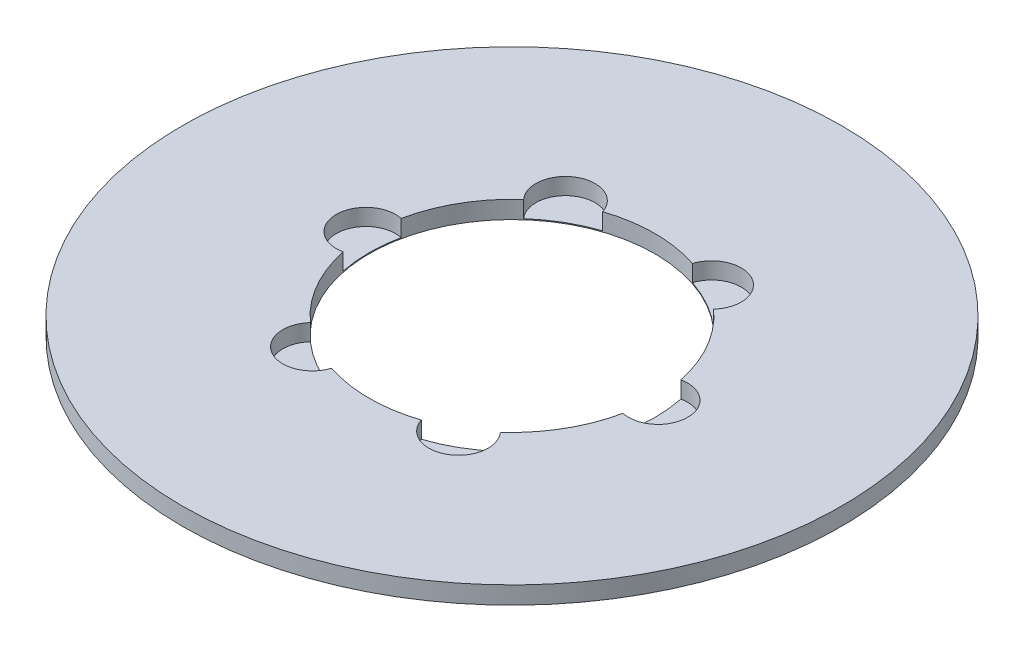
ISO-10303-21;
HEADER;
FILE_DESCRIPTION(('STEP AP214'),'2;1');
FILE_NAME('part.step','',(''),(''),'','','');
FILE_SCHEMA(('AUTOMOTIVE_DESIGN { 1 0 10303 214 1 1 1 1 }'));
ENDSEC;
DATA;
#1=APPLICATION_CONTEXT('core data for automotive mechanical design processes');
#2=APPLICATION_PROTOCOL_DEFINITION('international standard','automotive_design',2000,#1);
#3=PRODUCT_CONTEXT('',#1,'mechanical');
#4=PRODUCT('Part','Part','',(#3));
#5=PRODUCT_RELATED_PRODUCT_CATEGORY('part','',(#4));
#6=PRODUCT_DEFINITION_FORMATION('','',#4);
#7=PRODUCT_DEFINITION_CONTEXT('part definition',#1,'design');
#8=PRODUCT_DEFINITION('design','',#6,#7);
#9=PRODUCT_DEFINITION_SHAPE('','',#8);
#10=(LENGTH_UNIT() NAMED_UNIT(*) SI_UNIT(.MILLI.,.METRE.));
#11=(NAMED_UNIT(*) PLANE_ANGLE_UNIT() SI_UNIT($,.RADIAN.));
#12=(NAMED_UNIT(*) SI_UNIT($,.STERADIAN.) SOLID_ANGLE_UNIT());
#13=UNCERTAINTY_MEASURE_WITH_UNIT(LENGTH_MEASURE(1.E-05),#10,'distance_accuracy_value','');
#14=(GEOMETRIC_REPRESENTATION_CONTEXT(3) GLOBAL_UNCERTAINTY_ASSIGNED_CONTEXT((#13)) GLOBAL_UNIT_ASSIGNED_CONTEXT((#10,
#11,#12)) REPRESENTATION_CONTEXT('',''));
#15=CARTESIAN_POINT('',(0.,0.,0.));
#16=DIRECTION('',(0.,0.,1.));
#17=DIRECTION('',(1.,0.,0.));
#18=AXIS2_PLACEMENT_3D('',#15,#16,#17);
#19=CARTESIAN_POINT('',(0.,4.,0.));
#20=DIRECTION('',(0.,-1.,0.));
#21=DIRECTION('',(0.,0.,-1.));
#22=AXIS2_PLACEMENT_3D('',#19,#20,#21);
#23=CYLINDRICAL_SURFACE('',#22,75.);
#24=CARTESIAN_POINT('',(0.,4.,0.));
#25=DIRECTION('',(0.,1.,0.));
#26=DIRECTION('',(0.,0.,1.));
#27=AXIS2_PLACEMENT_3D('',#24,#25,#26);
#28=CIRCLE('',#27,75.);
#29=CARTESIAN_POINT('',(0.,4.,75.));
#30=VERTEX_POINT('',#29);
#31=EDGE_CURVE('E171',#30,#30,#28,.T.);
#32=ORIENTED_EDGE('',*,*,#31,.F.);
#33=EDGE_LOOP('',(#32));
#34=FACE_BOUND('',#33,.T.);
#35=CARTESIAN_POINT('',(0.,0.,0.));
#36=DIRECTION('',(0.,1.,0.));
#37=DIRECTION('',(0.,0.,1.));
#38=AXIS2_PLACEMENT_3D('',#35,#36,#37);
#39=CIRCLE('',#38,75.);
#40=CARTESIAN_POINT('',(0.,0.,75.));
#41=VERTEX_POINT('',#40);
#42=EDGE_CURVE('E157',#41,#41,#39,.T.);
#43=ORIENTED_EDGE('',*,*,#42,.T.);
#44=EDGE_LOOP('',(#43));
#45=FACE_BOUND('',#44,.T.);
#46=ADVANCED_FACE('F39',(#34,#45),#23,.T.);
#47=CARTESIAN_POINT('',(0.,4.,0.));
#48=DIRECTION('',(0.,1.,0.));
#49=DIRECTION('',(0.,0.,1.));
#50=AXIS2_PLACEMENT_3D('',#47,#48,#49);
#51=PLANE('',#50);
#52=CARTESIAN_POINT('',(-16.6261189361945,4.,-28.7972827301712));
#53=DIRECTION('',(0.,1.,0.));
#54=DIRECTION('',(-0.866025403784433,0.,0.50000000000001));
#55=AXIS2_PLACEMENT_3D('',#52,#53,#54);
#56=CIRCLE('',#55,6.74282518427116);
#57=CARTESIAN_POINT('',(-10.205310516986,4.,-30.8561442382533));
#58=VERTEX_POINT('',#57);
#59=CARTESIAN_POINT('',(-21.6195495146718,4.,-24.2661302803446));
#60=VERTEX_POINT('',#59);
#61=EDGE_CURVE('E214',#58,#60,#56,.T.);
#62=ORIENTED_EDGE('',*,*,#61,.F.);
#63=CARTESIAN_POINT('',(0.,4.,0.));
#64=DIRECTION('',(0.,1.,0.));
#65=DIRECTION('',(0.,0.,1.));
#66=AXIS2_PLACEMENT_3D('',#63,#64,#65);
#67=CIRCLE('',#66,32.5);
#68=CARTESIAN_POINT('',(10.2053105169854,4.,-30.8561442382536));
#69=VERTEX_POINT('',#68);
#70=EDGE_CURVE('E272',#69,#58,#67,.T.);
#71=ORIENTED_EDGE('',*,*,#70,.F.);
#72=CARTESIAN_POINT('',(16.6261189361939,4.,-28.7972827301715));
#73=DIRECTION('',(0.,1.,0.));
#74=DIRECTION('',(-0.866025403784443,0.,-0.499999999999992));
#75=AXIS2_PLACEMENT_3D('',#72,#73,#74);
#76=CIRCLE('',#75,6.74282518427116);
#77=CARTESIAN_POINT('',(21.6195495146713,4.,-24.266130280345));
#78=VERTEX_POINT('',#77);
#79=EDGE_CURVE('E285',#78,#69,#76,.T.);
#80=ORIENTED_EDGE('',*,*,#79,.F.);
#81=CARTESIAN_POINT('',(31.8248600316572,4.,-6.59001395790865));
#82=VERTEX_POINT('',#81);
#83=EDGE_CURVE('E165',#82,#78,#67,.T.);
#84=ORIENTED_EDGE('',*,*,#83,.F.);
#85=CARTESIAN_POINT('',(33.2522378723884,4.,0.));
#86=DIRECTION('',(0.,1.,0.));
#87=DIRECTION('',(0.,0.,-1.));
#88=AXIS2_PLACEMENT_3D('',#85,#86,#87);
#89=CIRCLE('',#88,6.74282518427116);
#90=CARTESIAN_POINT('',(31.8248600316572,4.,6.59001395790865));
#91=VERTEX_POINT('',#90);
#92=EDGE_CURVE('E281',#91,#82,#89,.T.);
#93=ORIENTED_EDGE('',*,*,#92,.F.);
#94=CARTESIAN_POINT('',(21.6195495146716,4.,24.2661302803447));
#95=VERTEX_POINT('',#94);
#96=EDGE_CURVE('E160',#95,#91,#67,.T.);
#97=ORIENTED_EDGE('',*,*,#96,.F.);
#98=CARTESIAN_POINT('',(16.6261189361943,4.,28.7972827301713));
#99=DIRECTION('',(0.,1.,0.));
#100=DIRECTION('',(0.866025403784436,0.,-0.500000000000004));
#101=AXIS2_PLACEMENT_3D('',#98,#99,#100);
#102=CIRCLE('',#101,6.74282518427116);
#103=CARTESIAN_POINT('',(10.2053105169858,4.,30.8561442382534));
#104=VERTEX_POINT('',#103);
#105=EDGE_CURVE('E154',#104,#95,#102,.T.);
#106=ORIENTED_EDGE('',*,*,#105,.F.);
#107=CARTESIAN_POINT('',(-10.2053105169856,4.,30.8561442382535));
#108=VERTEX_POINT('',#107);
#109=EDGE_CURVE('E150',#108,#104,#67,.T.);
#110=ORIENTED_EDGE('',*,*,#109,.F.);
#111=CARTESIAN_POINT('',(-16.6261189361941,4.,28.7972827301714));
#112=DIRECTION('',(0.,1.,0.));
#113=DIRECTION('',(0.86602540378444,0.,0.499999999999998));
#114=AXIS2_PLACEMENT_3D('',#111,#112,#113);
#115=CIRCLE('',#114,6.74282518427116);
#116=CARTESIAN_POINT('',(-21.6195495146715,4.,24.2661302803449));
#117=VERTEX_POINT('',#116);
#118=EDGE_CURVE('E127',#117,#108,#115,.T.);
#119=ORIENTED_EDGE('',*,*,#118,.F.);
#120=CARTESIAN_POINT('',(-31.8248600316572,4.,6.59001395790865));
#121=VERTEX_POINT('',#120);
#122=EDGE_CURVE('E156',#121,#117,#67,.T.);
#123=ORIENTED_EDGE('',*,*,#122,.F.);
#124=CARTESIAN_POINT('',(-33.2522378723884,4.,0.));
#125=DIRECTION('',(0.,1.,0.));
#126=DIRECTION('',(0.,0.,1.));
#127=AXIS2_PLACEMENT_3D('',#124,#125,#126);
#128=CIRCLE('',#127,6.74282518427116);
#129=CARTESIAN_POINT('',(-31.8248600316572,4.,-6.59001395790865));
#130=VERTEX_POINT('',#129);
#131=EDGE_CURVE('E164',#130,#121,#128,.T.);
#132=ORIENTED_EDGE('',*,*,#131,.F.);
#133=EDGE_CURVE('E159',#60,#130,#67,.T.);
#134=ORIENTED_EDGE('',*,*,#133,.F.);
#135=EDGE_LOOP('',(#62,#71,#80,#84,#93,#97,#106,#110,#119,#123,#132,#134));
#136=FACE_BOUND('',#135,.T.);
#137=ORIENTED_EDGE('',*,*,#31,.T.);
#138=EDGE_LOOP('',(#137));
#139=FACE_BOUND('',#138,.T.);
#140=ADVANCED_FACE('F155',(#136,#139),#51,.T.);
#141=CARTESIAN_POINT('',(0.,0.,0.));
#142=DIRECTION('',(0.,1.,0.));
#143=DIRECTION('',(0.,0.,1.));
#144=AXIS2_PLACEMENT_3D('',#141,#142,#143);
#145=PLANE('',#144);
#146=CARTESIAN_POINT('',(0.,0.,0.));
#147=DIRECTION('',(0.,1.,0.));
#148=DIRECTION('',(0.,0.,1.));
#149=AXIS2_PLACEMENT_3D('',#146,#147,#148);
#150=CIRCLE('',#149,32.5);
#151=CARTESIAN_POINT('',(0.,0.,32.5));
#152=VERTEX_POINT('',#151);
#153=EDGE_CURVE('E170',#152,#152,#150,.T.);
#154=ORIENTED_EDGE('',*,*,#153,.T.);
#155=EDGE_LOOP('',(#154));
#156=FACE_BOUND('',#155,.T.);
#157=ORIENTED_EDGE('',*,*,#42,.F.);
#158=EDGE_LOOP('',(#157));
#159=FACE_BOUND('',#158,.T.);
#160=ADVANCED_FACE('F232',(#156,#159),#145,.F.);
#161=CARTESIAN_POINT('',(0.,4.,0.));
#162=DIRECTION('',(0.,-1.,0.));
#163=DIRECTION('',(0.,0.,-1.));
#164=AXIS2_PLACEMENT_3D('',#161,#162,#163);
#165=CYLINDRICAL_SURFACE('',#164,32.5);
#166=DIRECTION('',(0.,1.,0.));
#167=VECTOR('',#166,1.);
#168=CARTESIAN_POINT('',(-10.205310516986,2.10799653906422,-30.8561442382533));
#169=LINE('',#168,#167);
#170=CARTESIAN_POINT('',(-10.205310516986,0.215993078128443,-30.8561442382533));
#171=VERTEX_POINT('',#170);
#172=EDGE_CURVE('E11',#171,#58,#169,.T.);
#173=ORIENTED_EDGE('',*,*,#172,.F.);
#174=CARTESIAN_POINT('',(0.,0.215993078128443,0.));
#175=DIRECTION('',(0.,1.,0.));
#176=DIRECTION('',(0.,0.,1.));
#177=AXIS2_PLACEMENT_3D('',#174,#175,#176);
#178=CIRCLE('',#177,32.5);
#179=CARTESIAN_POINT('',(-21.6195495146718,0.215993078128443,-24.2661302803446));
#180=VERTEX_POINT('',#179);
#181=EDGE_CURVE('E209',#171,#180,#178,.T.);
#182=ORIENTED_EDGE('',*,*,#181,.T.);
#183=DIRECTION('',(0.,1.,0.));
#184=VECTOR('',#183,1.);
#185=CARTESIAN_POINT('',(-21.6195495146718,2.10799653906422,-24.2661302803446));
#186=LINE('',#185,#184);
#187=EDGE_CURVE('E46',#60,#180,#186,.F.);
#188=ORIENTED_EDGE('',*,*,#187,.F.);
#189=ORIENTED_EDGE('',*,*,#133,.T.);
#190=DIRECTION('',(0.,1.,0.));
#191=VECTOR('',#190,1.);
#192=CARTESIAN_POINT('',(-31.8248600316572,2.10799653906422,-6.59001395790865));
#193=LINE('',#192,#191);
#194=CARTESIAN_POINT('',(-31.8248600316572,0.215993078128443,-6.59001395790865));
#195=VERTEX_POINT('',#194);
#196=EDGE_CURVE('E185',#195,#130,#193,.T.);
#197=ORIENTED_EDGE('',*,*,#196,.F.);
#198=CARTESIAN_POINT('',(0.,0.215993078128443,0.));
#199=DIRECTION('',(0.,1.,0.));
#200=DIRECTION('',(0.,0.,1.));
#201=AXIS2_PLACEMENT_3D('',#198,#199,#200);
#202=CIRCLE('',#201,32.5);
#203=CARTESIAN_POINT('',(-31.8248600316572,0.215993078128443,6.59001395790865));
#204=VERTEX_POINT('',#203);
#205=EDGE_CURVE('E173',#195,#204,#202,.T.);
#206=ORIENTED_EDGE('',*,*,#205,.T.);
#207=DIRECTION('',(0.,1.,0.));
#208=VECTOR('',#207,1.);
#209=CARTESIAN_POINT('',(-31.8248600316572,2.10799653906422,6.59001395790865));
#210=LINE('',#209,#208);
#211=EDGE_CURVE('E178',#121,#204,#210,.F.);
#212=ORIENTED_EDGE('',*,*,#211,.F.);
#213=ORIENTED_EDGE('',*,*,#122,.T.);
#214=DIRECTION('',(0.,1.,0.));
#215=VECTOR('',#214,1.);
#216=CARTESIAN_POINT('',(-21.6195495146714,2.10799653906422,24.2661302803449));
#217=LINE('',#216,#215);
#218=CARTESIAN_POINT('',(-21.6195495146715,0.215993078128443,24.2661302803449));
#219=VERTEX_POINT('',#218);
#220=EDGE_CURVE('E132',#219,#117,#217,.T.);
#221=ORIENTED_EDGE('',*,*,#220,.F.);
#222=CARTESIAN_POINT('',(0.,0.215993078128443,0.));
#223=DIRECTION('',(0.,1.,0.));
#224=DIRECTION('',(0.,0.,1.));
#225=AXIS2_PLACEMENT_3D('',#222,#223,#224);
#226=CIRCLE('',#225,32.5);
#227=CARTESIAN_POINT('',(-10.2053105169856,0.215993078128443,30.8561442382535));
#228=VERTEX_POINT('',#227);
#229=EDGE_CURVE('E146',#219,#228,#226,.T.);
#230=ORIENTED_EDGE('',*,*,#229,.T.);
#231=DIRECTION('',(0.,1.,0.));
#232=VECTOR('',#231,1.);
#233=CARTESIAN_POINT('',(-10.2053105169856,2.10799653906422,30.8561442382535));
#234=LINE('',#233,#232);
#235=EDGE_CURVE('E128',#108,#228,#234,.F.);
#236=ORIENTED_EDGE('',*,*,#235,.F.);
#237=ORIENTED_EDGE('',*,*,#109,.T.);
#238=DIRECTION('',(0.,1.,0.));
#239=VECTOR('',#238,1.);
#240=CARTESIAN_POINT('',(10.2053105169858,2.10799653906422,30.8561442382534));
#241=LINE('',#240,#239);
#242=CARTESIAN_POINT('',(10.2053105169858,0.215993078128443,30.8561442382534));
#243=VERTEX_POINT('',#242);
#244=EDGE_CURVE('E192',#243,#104,#241,.T.);
#245=ORIENTED_EDGE('',*,*,#244,.F.);
#246=CARTESIAN_POINT('',(0.,0.215993078128443,0.));
#247=DIRECTION('',(0.,1.,0.));
#248=DIRECTION('',(0.,0.,1.));
#249=AXIS2_PLACEMENT_3D('',#246,#247,#248);
#250=CIRCLE('',#249,32.5);
#251=CARTESIAN_POINT('',(21.6195495146716,0.215993078128443,24.2661302803447));
#252=VERTEX_POINT('',#251);
#253=EDGE_CURVE('E190',#243,#252,#250,.T.);
#254=ORIENTED_EDGE('',*,*,#253,.T.);
#255=DIRECTION('',(0.,1.,0.));
#256=VECTOR('',#255,1.);
#257=CARTESIAN_POINT('',(21.6195495146716,2.10799653906422,24.2661302803447));
#258=LINE('',#257,#256);
#259=EDGE_CURVE('E189',#95,#252,#258,.F.);
#260=ORIENTED_EDGE('',*,*,#259,.F.);
#261=ORIENTED_EDGE('',*,*,#96,.T.);
#262=DIRECTION('',(0.,1.,0.));
#263=VECTOR('',#262,1.);
#264=CARTESIAN_POINT('',(31.8248600316572,2.10799653906422,6.59001395790865));
#265=LINE('',#264,#263);
#266=CARTESIAN_POINT('',(31.8248600316572,0.215993078128443,6.59001395790865));
#267=VERTEX_POINT('',#266);
#268=EDGE_CURVE('E203',#267,#91,#265,.T.);
#269=ORIENTED_EDGE('',*,*,#268,.F.);
#270=CARTESIAN_POINT('',(0.,0.215993078128443,0.));
#271=DIRECTION('',(0.,1.,0.));
#272=DIRECTION('',(0.,0.,1.));
#273=AXIS2_PLACEMENT_3D('',#270,#271,#272);
#274=CIRCLE('',#273,32.5);
#275=CARTESIAN_POINT('',(31.8248600316572,0.215993078128443,-6.59001395790865));
#276=VERTEX_POINT('',#275);
#277=EDGE_CURVE('E194',#267,#276,#274,.T.);
#278=ORIENTED_EDGE('',*,*,#277,.T.);
#279=DIRECTION('',(0.,1.,0.));
#280=VECTOR('',#279,1.);
#281=CARTESIAN_POINT('',(31.8248600316572,2.10799653906422,-6.59001395790865));
#282=LINE('',#281,#280);
#283=EDGE_CURVE('E196',#82,#276,#282,.F.);
#284=ORIENTED_EDGE('',*,*,#283,.F.);
#285=ORIENTED_EDGE('',*,*,#83,.T.);
#286=DIRECTION('',(0.,1.,0.));
#287=VECTOR('',#286,1.);
#288=CARTESIAN_POINT('',(21.6195495146713,2.10799653906422,-24.266130280345));
#289=LINE('',#288,#287);
#290=CARTESIAN_POINT('',(21.6195495146713,0.215993078128443,-24.266130280345));
#291=VERTEX_POINT('',#290);
#292=EDGE_CURVE('E208',#291,#78,#289,.T.);
#293=ORIENTED_EDGE('',*,*,#292,.F.);
#294=CARTESIAN_POINT('',(0.,0.215993078128443,0.));
#295=DIRECTION('',(0.,1.,0.));
#296=DIRECTION('',(0.,0.,1.));
#297=AXIS2_PLACEMENT_3D('',#294,#295,#296);
#298=CIRCLE('',#297,32.5);
#299=CARTESIAN_POINT('',(10.2053105169854,0.215993078128443,-30.8561442382536));
#300=VERTEX_POINT('',#299);
#301=EDGE_CURVE('E201',#291,#300,#298,.T.);
#302=ORIENTED_EDGE('',*,*,#301,.T.);
#303=DIRECTION('',(0.,1.,0.));
#304=VECTOR('',#303,1.);
#305=CARTESIAN_POINT('',(10.2053105169854,2.10799653906422,-30.8561442382536));
#306=LINE('',#305,#304);
#307=EDGE_CURVE('E206',#69,#300,#306,.F.);
#308=ORIENTED_EDGE('',*,*,#307,.F.);
#309=ORIENTED_EDGE('',*,*,#70,.T.);
#310=EDGE_LOOP('',(#173,#182,#188,#189,#197,#206,#212,#213,#221,#230,#236,#237,#245,#254,#260,
#261,#269,#278,#284,#285,#293,#302,#308,#309));
#311=FACE_BOUND('',#310,.T.);
#312=ORIENTED_EDGE('',*,*,#153,.F.);
#313=EDGE_LOOP('',(#312));
#314=FACE_BOUND('',#313,.T.);
#315=ADVANCED_FACE('F145',(#311,#314),#165,.F.);
#316=CARTESIAN_POINT('',(-33.2522378723884,0.215993078128443,0.));
#317=DIRECTION('',(0.,1.,0.));
#318=DIRECTION('',(0.,0.,1.));
#319=AXIS2_PLACEMENT_3D('',#316,#317,#318);
#320=CYLINDRICAL_SURFACE('',#319,6.74282518427116);
#321=ORIENTED_EDGE('',*,*,#196,.T.);
#322=ORIENTED_EDGE('',*,*,#131,.T.);
#323=ORIENTED_EDGE('',*,*,#211,.T.);
#324=CARTESIAN_POINT('',(-33.2522378723884,0.215993078128443,0.));
#325=DIRECTION('',(0.,1.,0.));
#326=DIRECTION('',(0.,0.,1.));
#327=AXIS2_PLACEMENT_3D('',#324,#325,#326);
#328=CIRCLE('',#327,6.74282518427116);
#329=EDGE_CURVE('E168',#195,#204,#328,.T.);
#330=ORIENTED_EDGE('',*,*,#329,.F.);
#331=EDGE_LOOP('',(#321,#322,#323,#330));
#332=FACE_BOUND('',#331,.T.);
#333=ADVANCED_FACE('F243',(#332),#320,.F.);
#334=CARTESIAN_POINT('',(-33.2522378723884,0.215993078128443,0.));
#335=DIRECTION('',(0.,1.,0.));
#336=DIRECTION('',(0.,0.,1.));
#337=AXIS2_PLACEMENT_3D('',#334,#335,#336);
#338=PLANE('',#337);
#339=ORIENTED_EDGE('',*,*,#329,.T.);
#340=ORIENTED_EDGE('',*,*,#205,.F.);
#341=EDGE_LOOP('',(#339,#340));
#342=FACE_BOUND('',#341,.T.);
#343=ADVANCED_FACE('F247',(#342),#338,.T.);
#344=CARTESIAN_POINT('',(-16.6261189361941,0.215993078128443,28.7972827301714));
#345=DIRECTION('',(0.,1.,0.));
#346=DIRECTION('',(0.,0.,1.));
#347=AXIS2_PLACEMENT_3D('',#344,#345,#346);
#348=CYLINDRICAL_SURFACE('',#347,6.74282518427116);
#349=ORIENTED_EDGE('',*,*,#220,.T.);
#350=ORIENTED_EDGE('',*,*,#118,.T.);
#351=ORIENTED_EDGE('',*,*,#235,.T.);
#352=CARTESIAN_POINT('',(-16.6261189361941,0.215993078128443,28.7972827301714));
#353=DIRECTION('',(0.,1.,0.));
#354=DIRECTION('',(0.86602540378444,0.,0.499999999999998));
#355=AXIS2_PLACEMENT_3D('',#352,#353,#354);
#356=CIRCLE('',#355,6.74282518427116);
#357=EDGE_CURVE('E137',#219,#228,#356,.T.);
#358=ORIENTED_EDGE('',*,*,#357,.F.);
#359=EDGE_LOOP('',(#349,#350,#351,#358));
#360=FACE_BOUND('',#359,.T.);
#361=ADVANCED_FACE('F126',(#360),#348,.F.);
#362=CARTESIAN_POINT('',(-16.6261189361941,0.215993078128443,28.7972827301714));
#363=DIRECTION('',(0.,1.,0.));
#364=DIRECTION('',(0.86602540378444,0.,0.499999999999998));
#365=AXIS2_PLACEMENT_3D('',#362,#363,#364);
#366=PLANE('',#365);
#367=ORIENTED_EDGE('',*,*,#357,.T.);
#368=ORIENTED_EDGE('',*,*,#229,.F.);
#369=EDGE_LOOP('',(#367,#368));
#370=FACE_BOUND('',#369,.T.);
#371=ADVANCED_FACE('F254',(#370),#366,.T.);
#372=CARTESIAN_POINT('',(16.6261189361943,0.215993078128443,28.7972827301713));
#373=DIRECTION('',(0.,1.,0.));
#374=DIRECTION('',(0.,0.,1.));
#375=AXIS2_PLACEMENT_3D('',#372,#373,#374);
#376=CYLINDRICAL_SURFACE('',#375,6.74282518427116);
#377=ORIENTED_EDGE('',*,*,#244,.T.);
#378=ORIENTED_EDGE('',*,*,#105,.T.);
#379=ORIENTED_EDGE('',*,*,#259,.T.);
#380=CARTESIAN_POINT('',(16.6261189361943,0.215993078128443,28.7972827301713));
#381=DIRECTION('',(0.,1.,0.));
#382=DIRECTION('',(0.866025403784436,0.,-0.500000000000004));
#383=AXIS2_PLACEMENT_3D('',#380,#381,#382);
#384=CIRCLE('',#383,6.74282518427116);
#385=EDGE_CURVE('E138',#243,#252,#384,.T.);
#386=ORIENTED_EDGE('',*,*,#385,.F.);
#387=EDGE_LOOP('',(#377,#378,#379,#386));
#388=FACE_BOUND('',#387,.T.);
#389=ADVANCED_FACE('F260',(#388),#376,.F.);
#390=CARTESIAN_POINT('',(16.6261189361943,0.215993078128443,28.7972827301713));
#391=DIRECTION('',(0.,1.,0.));
#392=DIRECTION('',(0.866025403784436,0.,-0.500000000000004));
#393=AXIS2_PLACEMENT_3D('',#390,#391,#392);
#394=PLANE('',#393);
#395=ORIENTED_EDGE('',*,*,#385,.T.);
#396=ORIENTED_EDGE('',*,*,#253,.F.);
#397=EDGE_LOOP('',(#395,#396));
#398=FACE_BOUND('',#397,.T.);
#399=ADVANCED_FACE('F265',(#398),#394,.T.);
#400=CARTESIAN_POINT('',(33.2522378723884,0.215993078128443,0.));
#401=DIRECTION('',(0.,1.,0.));
#402=DIRECTION('',(0.,0.,1.));
#403=AXIS2_PLACEMENT_3D('',#400,#401,#402);
#404=CYLINDRICAL_SURFACE('',#403,6.74282518427116);
#405=ORIENTED_EDGE('',*,*,#268,.T.);
#406=ORIENTED_EDGE('',*,*,#92,.T.);
#407=ORIENTED_EDGE('',*,*,#283,.T.);
#408=CARTESIAN_POINT('',(33.2522378723884,0.215993078128443,0.));
#409=DIRECTION('',(0.,1.,0.));
#410=DIRECTION('',(0.,0.,-1.));
#411=AXIS2_PLACEMENT_3D('',#408,#409,#410);
#412=CIRCLE('',#411,6.74282518427116);
#413=EDGE_CURVE('E287',#267,#276,#412,.T.);
#414=ORIENTED_EDGE('',*,*,#413,.F.);
#415=EDGE_LOOP('',(#405,#406,#407,#414));
#416=FACE_BOUND('',#415,.T.);
#417=ADVANCED_FACE('F300',(#416),#404,.F.);
#418=CARTESIAN_POINT('',(33.2522378723884,0.215993078128443,0.));
#419=DIRECTION('',(0.,1.,0.));
#420=DIRECTION('',(0.,0.,-1.));
#421=AXIS2_PLACEMENT_3D('',#418,#419,#420);
#422=PLANE('',#421);
#423=ORIENTED_EDGE('',*,*,#413,.T.);
#424=ORIENTED_EDGE('',*,*,#277,.F.);
#425=EDGE_LOOP('',(#423,#424));
#426=FACE_BOUND('',#425,.T.);
#427=ADVANCED_FACE('F298',(#426),#422,.T.);
#428=CARTESIAN_POINT('',(16.6261189361939,0.215993078128443,-28.7972827301715));
#429=DIRECTION('',(0.,1.,0.));
#430=DIRECTION('',(0.,0.,1.));
#431=AXIS2_PLACEMENT_3D('',#428,#429,#430);
#432=CYLINDRICAL_SURFACE('',#431,6.74282518427116);
#433=ORIENTED_EDGE('',*,*,#292,.T.);
#434=ORIENTED_EDGE('',*,*,#79,.T.);
#435=ORIENTED_EDGE('',*,*,#307,.T.);
#436=CARTESIAN_POINT('',(16.6261189361939,0.215993078128443,-28.7972827301715));
#437=DIRECTION('',(0.,1.,0.));
#438=DIRECTION('',(-0.866025403784443,0.,-0.499999999999992));
#439=AXIS2_PLACEMENT_3D('',#436,#437,#438);
#440=CIRCLE('',#439,6.74282518427116);
#441=EDGE_CURVE('E56',#291,#300,#440,.T.);
#442=ORIENTED_EDGE('',*,*,#441,.F.);
#443=EDGE_LOOP('',(#433,#434,#435,#442));
#444=FACE_BOUND('',#443,.T.);
#445=ADVANCED_FACE('F301',(#444),#432,.F.);
#446=CARTESIAN_POINT('',(16.6261189361939,0.215993078128443,-28.7972827301715));
#447=DIRECTION('',(0.,1.,0.));
#448=DIRECTION('',(-0.866025403784443,0.,-0.499999999999992));
#449=AXIS2_PLACEMENT_3D('',#446,#447,#448);
#450=PLANE('',#449);
#451=ORIENTED_EDGE('',*,*,#441,.T.);
#452=ORIENTED_EDGE('',*,*,#301,.F.);
#453=EDGE_LOOP('',(#451,#452));
#454=FACE_BOUND('',#453,.T.);
#455=ADVANCED_FACE('F221',(#454),#450,.T.);
#456=CARTESIAN_POINT('',(-16.6261189361945,0.215993078128443,-28.7972827301712));
#457=DIRECTION('',(0.,1.,0.));
#458=DIRECTION('',(0.,0.,1.));
#459=AXIS2_PLACEMENT_3D('',#456,#457,#458);
#460=CYLINDRICAL_SURFACE('',#459,6.74282518427116);
#461=ORIENTED_EDGE('',*,*,#172,.T.);
#462=ORIENTED_EDGE('',*,*,#61,.T.);
#463=ORIENTED_EDGE('',*,*,#187,.T.);
#464=CARTESIAN_POINT('',(-16.6261189361945,0.215993078128443,-28.7972827301712));
#465=DIRECTION('',(0.,1.,0.));
#466=DIRECTION('',(-0.866025403784433,0.,0.50000000000001));
#467=AXIS2_PLACEMENT_3D('',#464,#465,#466);
#468=CIRCLE('',#467,6.74282518427116);
#469=EDGE_CURVE('E55',#171,#180,#468,.T.);
#470=ORIENTED_EDGE('',*,*,#469,.F.);
#471=EDGE_LOOP('',(#461,#462,#463,#470));
#472=FACE_BOUND('',#471,.T.);
#473=ADVANCED_FACE('F212',(#472),#460,.F.);
#474=CARTESIAN_POINT('',(-16.6261189361945,0.215993078128443,-28.7972827301712));
#475=DIRECTION('',(0.,1.,0.));
#476=DIRECTION('',(-0.866025403784433,0.,0.50000000000001));
#477=AXIS2_PLACEMENT_3D('',#474,#475,#476);
#478=PLANE('',#477);
#479=ORIENTED_EDGE('',*,*,#469,.T.);
#480=ORIENTED_EDGE('',*,*,#181,.F.);
#481=EDGE_LOOP('',(#479,#480));
#482=FACE_BOUND('',#481,.T.);
#483=ADVANCED_FACE('F217',(#482),#478,.T.);
#484=CLOSED_SHELL('',(#46,#140,#160,#315,#333,#343,#361,#371,#389,#399,#417,#427,#445,#455,#473,#483));
#485=MANIFOLD_SOLID_BREP('B2',#484);
#486=ADVANCED_BREP_SHAPE_REPRESENTATION('',(#18,#485),#14);
#487=SHAPE_DEFINITION_REPRESENTATION(#9,#486);
ENDSEC;
END-ISO-10303-21;
